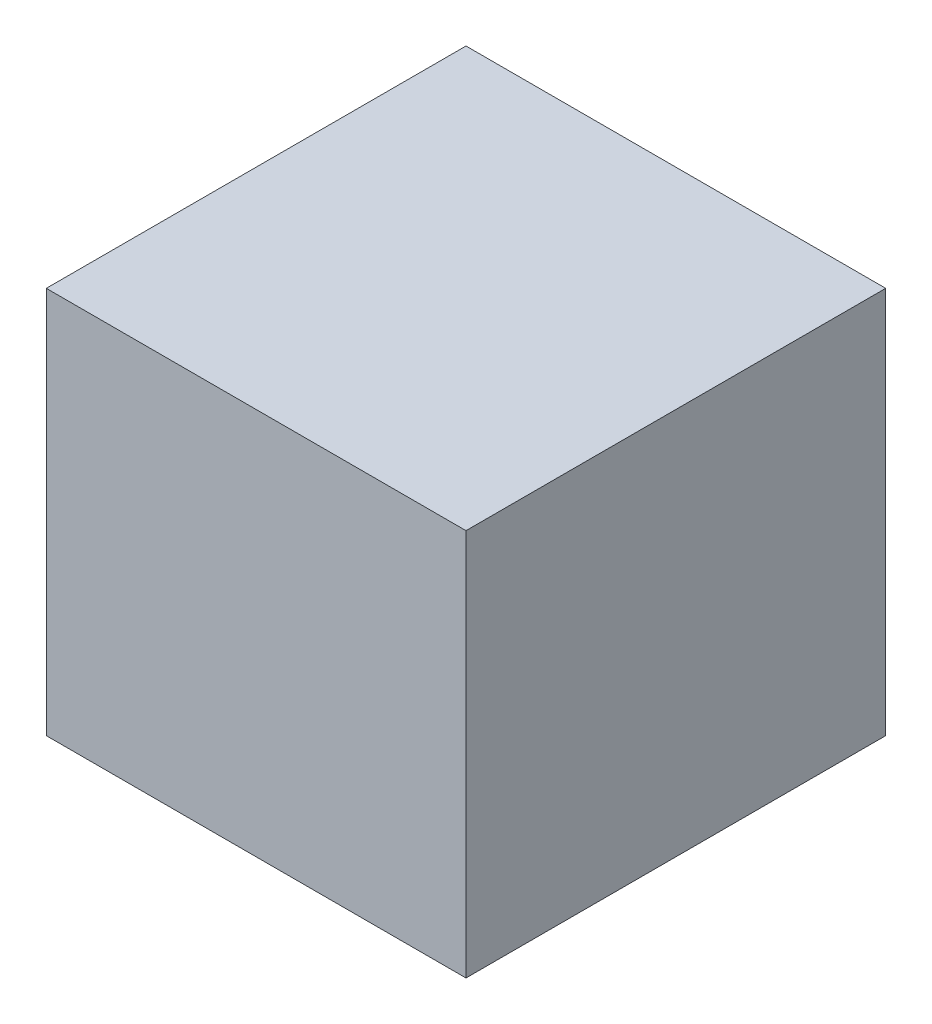
ISO-10303-21;
HEADER;
FILE_DESCRIPTION(('STEP AP214'),'2;1');
FILE_NAME('part.step','',(''),(''),'','','');
FILE_SCHEMA(('AUTOMOTIVE_DESIGN { 1 0 10303 214 1 1 1 1 }'));
ENDSEC;
DATA;
#1=APPLICATION_CONTEXT('core data for automotive mechanical design processes');
#2=APPLICATION_PROTOCOL_DEFINITION('international standard','automotive_design',2000,#1);
#3=PRODUCT_CONTEXT('',#1,'mechanical');
#4=PRODUCT('Part','Part','',(#3));
#5=PRODUCT_RELATED_PRODUCT_CATEGORY('part','',(#4));
#6=PRODUCT_DEFINITION_FORMATION('','',#4);
#7=PRODUCT_DEFINITION_CONTEXT('part definition',#1,'design');
#8=PRODUCT_DEFINITION('design','',#6,#7);
#9=PRODUCT_DEFINITION_SHAPE('','',#8);
#10=(LENGTH_UNIT() NAMED_UNIT(*) SI_UNIT(.MILLI.,.METRE.));
#11=(NAMED_UNIT(*) PLANE_ANGLE_UNIT() SI_UNIT($,.RADIAN.));
#12=(NAMED_UNIT(*) SI_UNIT($,.STERADIAN.) SOLID_ANGLE_UNIT());
#13=UNCERTAINTY_MEASURE_WITH_UNIT(LENGTH_MEASURE(1.E-05),#10,'distance_accuracy_value','');
#14=(GEOMETRIC_REPRESENTATION_CONTEXT(3) GLOBAL_UNCERTAINTY_ASSIGNED_CONTEXT((#13)) GLOBAL_UNIT_ASSIGNED_CONTEXT((#10,
#11,#12)) REPRESENTATION_CONTEXT('',''));
#15=CARTESIAN_POINT('',(0.,0.,0.));
#16=DIRECTION('',(0.,0.,1.));
#17=DIRECTION('',(1.,0.,0.));
#18=AXIS2_PLACEMENT_3D('',#15,#16,#17);
#19=CARTESIAN_POINT('',(16.25,30.,-16.25));
#20=DIRECTION('',(-1.,0.,0.));
#21=DIRECTION('',(0.,0.,1.));
#22=AXIS2_PLACEMENT_3D('',#19,#20,#21);
#23=PLANE('',#22);
#24=DIRECTION('',(0.,0.,-1.));
#25=VECTOR('',#24,1.);
#26=CARTESIAN_POINT('',(16.25,0.,-16.25));
#27=LINE('',#26,#25);
#28=CARTESIAN_POINT('',(16.25,0.,16.25));
#29=VERTEX_POINT('',#28);
#30=CARTESIAN_POINT('',(16.25,0.,-16.25));
#31=VERTEX_POINT('',#30);
#32=EDGE_CURVE('E113',#29,#31,#27,.T.);
#33=ORIENTED_EDGE('',*,*,#32,.T.);
#34=DIRECTION('',(0.,-1.,0.));
#35=VECTOR('',#34,1.);
#36=CARTESIAN_POINT('',(16.25,30.,-16.25));
#37=LINE('',#36,#35);
#38=CARTESIAN_POINT('',(16.25,30.,-16.25));
#39=VERTEX_POINT('',#38);
#40=EDGE_CURVE('E11',#39,#31,#37,.T.);
#41=ORIENTED_EDGE('',*,*,#40,.F.);
#42=DIRECTION('',(0.,0.,-1.));
#43=VECTOR('',#42,1.);
#44=CARTESIAN_POINT('',(16.25,30.,-16.25));
#45=LINE('',#44,#43);
#46=CARTESIAN_POINT('',(16.25,30.,16.25));
#47=VERTEX_POINT('',#46);
#48=EDGE_CURVE('E97',#47,#39,#45,.T.);
#49=ORIENTED_EDGE('',*,*,#48,.F.);
#50=DIRECTION('',(0.,-1.,0.));
#51=VECTOR('',#50,1.);
#52=CARTESIAN_POINT('',(16.25,30.,16.25));
#53=LINE('',#52,#51);
#54=EDGE_CURVE('E109',#47,#29,#53,.T.);
#55=ORIENTED_EDGE('',*,*,#54,.T.);
#56=EDGE_LOOP('',(#33,#41,#49,#55));
#57=FACE_BOUND('',#56,.T.);
#58=ADVANCED_FACE('F45',(#57),#23,.F.);
#59=CARTESIAN_POINT('',(-16.25,30.,-16.25));
#60=DIRECTION('',(0.,0.,1.));
#61=DIRECTION('',(1.,0.,0.));
#62=AXIS2_PLACEMENT_3D('',#59,#60,#61);
#63=PLANE('',#62);
#64=DIRECTION('',(-1.,0.,0.));
#65=VECTOR('',#64,1.);
#66=CARTESIAN_POINT('',(-16.25,0.,-16.25));
#67=LINE('',#66,#65);
#68=CARTESIAN_POINT('',(-16.25,0.,-16.25));
#69=VERTEX_POINT('',#68);
#70=EDGE_CURVE('E102',#31,#69,#67,.T.);
#71=ORIENTED_EDGE('',*,*,#70,.T.);
#72=DIRECTION('',(0.,-1.,0.));
#73=VECTOR('',#72,1.);
#74=CARTESIAN_POINT('',(-16.25,30.,-16.25));
#75=LINE('',#74,#73);
#76=CARTESIAN_POINT('',(-16.25,30.,-16.25));
#77=VERTEX_POINT('',#76);
#78=EDGE_CURVE('E54',#77,#69,#75,.T.);
#79=ORIENTED_EDGE('',*,*,#78,.F.);
#80=DIRECTION('',(-1.,0.,0.));
#81=VECTOR('',#80,1.);
#82=CARTESIAN_POINT('',(-16.25,30.,-16.25));
#83=LINE('',#82,#81);
#84=EDGE_CURVE('E92',#39,#77,#83,.T.);
#85=ORIENTED_EDGE('',*,*,#84,.F.);
#86=ORIENTED_EDGE('',*,*,#40,.T.);
#87=EDGE_LOOP('',(#71,#79,#85,#86));
#88=FACE_BOUND('',#87,.T.);
#89=ADVANCED_FACE('F101',(#88),#63,.F.);
#90=CARTESIAN_POINT('',(-16.25,30.,-16.25));
#91=DIRECTION('',(1.,0.,0.));
#92=DIRECTION('',(0.,0.,-1.));
#93=AXIS2_PLACEMENT_3D('',#90,#91,#92);
#94=PLANE('',#93);
#95=DIRECTION('',(0.,0.,1.));
#96=VECTOR('',#95,1.);
#97=CARTESIAN_POINT('',(-16.25,0.,-16.25));
#98=LINE('',#97,#96);
#99=CARTESIAN_POINT('',(-16.25,0.,16.25));
#100=VERTEX_POINT('',#99);
#101=EDGE_CURVE('E79',#69,#100,#98,.T.);
#102=ORIENTED_EDGE('',*,*,#101,.T.);
#103=DIRECTION('',(0.,-1.,0.));
#104=VECTOR('',#103,1.);
#105=CARTESIAN_POINT('',(-16.25,30.,16.25));
#106=LINE('',#105,#104);
#107=CARTESIAN_POINT('',(-16.25,30.,16.25));
#108=VERTEX_POINT('',#107);
#109=EDGE_CURVE('E104',#108,#100,#106,.T.);
#110=ORIENTED_EDGE('',*,*,#109,.F.);
#111=DIRECTION('',(0.,0.,1.));
#112=VECTOR('',#111,1.);
#113=CARTESIAN_POINT('',(-16.25,30.,-16.25));
#114=LINE('',#113,#112);
#115=EDGE_CURVE('E95',#77,#108,#114,.T.);
#116=ORIENTED_EDGE('',*,*,#115,.F.);
#117=ORIENTED_EDGE('',*,*,#78,.T.);
#118=EDGE_LOOP('',(#102,#110,#116,#117));
#119=FACE_BOUND('',#118,.T.);
#120=ADVANCED_FACE('F105',(#119),#94,.F.);
#121=CARTESIAN_POINT('',(-16.25,30.,16.25));
#122=DIRECTION('',(0.,0.,-1.));
#123=DIRECTION('',(-1.,0.,0.));
#124=AXIS2_PLACEMENT_3D('',#121,#122,#123);
#125=PLANE('',#124);
#126=DIRECTION('',(1.,0.,0.));
#127=VECTOR('',#126,1.);
#128=CARTESIAN_POINT('',(-16.25,0.,16.25));
#129=LINE('',#128,#127);
#130=EDGE_CURVE('E85',#100,#29,#129,.T.);
#131=ORIENTED_EDGE('',*,*,#130,.T.);
#132=ORIENTED_EDGE('',*,*,#54,.F.);
#133=DIRECTION('',(1.,0.,0.));
#134=VECTOR('',#133,1.);
#135=CARTESIAN_POINT('',(-16.25,30.,16.25));
#136=LINE('',#135,#134);
#137=EDGE_CURVE('E62',#108,#47,#136,.T.);
#138=ORIENTED_EDGE('',*,*,#137,.F.);
#139=ORIENTED_EDGE('',*,*,#109,.T.);
#140=EDGE_LOOP('',(#131,#132,#138,#139));
#141=FACE_BOUND('',#140,.T.);
#142=ADVANCED_FACE('F126',(#141),#125,.F.);
#143=CARTESIAN_POINT('',(0.,30.,0.));
#144=DIRECTION('',(0.,1.,0.));
#145=DIRECTION('',(0.,0.,1.));
#146=AXIS2_PLACEMENT_3D('',#143,#144,#145);
#147=PLANE('',#146);
#148=ORIENTED_EDGE('',*,*,#48,.T.);
#149=ORIENTED_EDGE('',*,*,#84,.T.);
#150=ORIENTED_EDGE('',*,*,#115,.T.);
#151=ORIENTED_EDGE('',*,*,#137,.T.);
#152=EDGE_LOOP('',(#148,#149,#150,#151));
#153=FACE_BOUND('',#152,.T.);
#154=ADVANCED_FACE('F93',(#153),#147,.T.);
#155=CARTESIAN_POINT('',(0.,0.,0.));
#156=DIRECTION('',(0.,1.,0.));
#157=DIRECTION('',(0.,0.,1.));
#158=AXIS2_PLACEMENT_3D('',#155,#156,#157);
#159=PLANE('',#158);
#160=ORIENTED_EDGE('',*,*,#32,.F.);
#161=ORIENTED_EDGE('',*,*,#130,.F.);
#162=ORIENTED_EDGE('',*,*,#101,.F.);
#163=ORIENTED_EDGE('',*,*,#70,.F.);
#164=EDGE_LOOP('',(#160,#161,#162,#163));
#165=FACE_BOUND('',#164,.T.);
#166=ADVANCED_FACE('F129',(#165),#159,.F.);
#167=CLOSED_SHELL('',(#58,#89,#120,#142,#154,#166));
#168=MANIFOLD_SOLID_BREP('B2',#167);
#169=ADVANCED_BREP_SHAPE_REPRESENTATION('',(#18,#168),#14);
#170=SHAPE_DEFINITION_REPRESENTATION(#9,#169);
ENDSEC;
END-ISO-10303-21;
